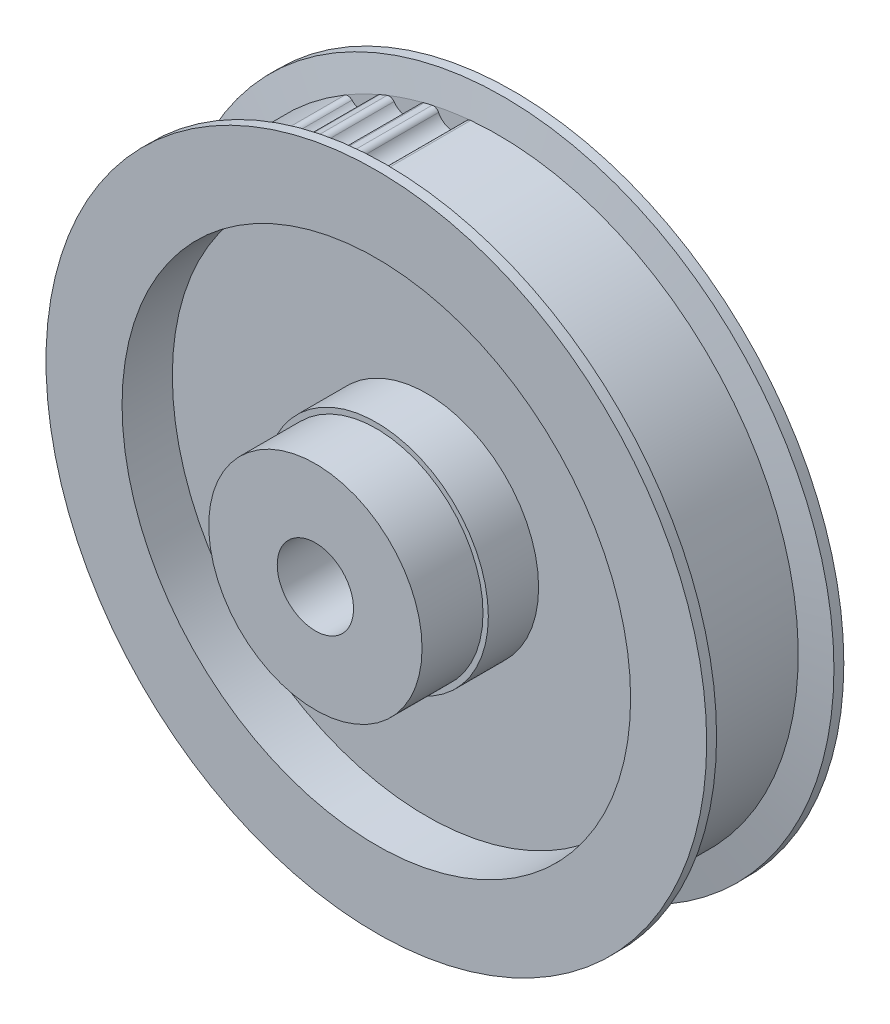
ISO-10303-21;
HEADER;
FILE_DESCRIPTION(('STEP AP214'),'2;1');
FILE_NAME('part.step','',(''),(''),'','','');
FILE_SCHEMA(('AUTOMOTIVE_DESIGN { 1 0 10303 214 1 1 1 1 }'));
ENDSEC;
DATA;
#1=APPLICATION_CONTEXT('core data for automotive mechanical design processes');
#2=APPLICATION_PROTOCOL_DEFINITION('international standard','automotive_design',2000,#1);
#3=PRODUCT_CONTEXT('',#1,'mechanical');
#4=PRODUCT('Part','Part','',(#3));
#5=PRODUCT_RELATED_PRODUCT_CATEGORY('part','',(#4));
#6=PRODUCT_DEFINITION_FORMATION('','',#4);
#7=PRODUCT_DEFINITION_CONTEXT('part definition',#1,'design');
#8=PRODUCT_DEFINITION('design','',#6,#7);
#9=PRODUCT_DEFINITION_SHAPE('','',#8);
#10=(LENGTH_UNIT() NAMED_UNIT(*) SI_UNIT(.MILLI.,.METRE.));
#11=(NAMED_UNIT(*) PLANE_ANGLE_UNIT() SI_UNIT($,.RADIAN.));
#12=(NAMED_UNIT(*) SI_UNIT($,.STERADIAN.) SOLID_ANGLE_UNIT());
#13=UNCERTAINTY_MEASURE_WITH_UNIT(LENGTH_MEASURE(1.E-05),#10,'distance_accuracy_value','');
#14=(GEOMETRIC_REPRESENTATION_CONTEXT(3) GLOBAL_UNCERTAINTY_ASSIGNED_CONTEXT((#13)) GLOBAL_UNIT_ASSIGNED_CONTEXT((#10,
#11,#12)) REPRESENTATION_CONTEXT('',''));
#15=CARTESIAN_POINT('',(0.,0.,0.));
#16=DIRECTION('',(0.,0.,1.));
#17=DIRECTION('',(1.,0.,0.));
#18=AXIS2_PLACEMENT_3D('',#15,#16,#17);
#19=CARTESIAN_POINT('',(0.,0.,13.49375));
#20=DIRECTION('',(0.,0.,1.));
#21=DIRECTION('',(1.,0.,0.));
#22=AXIS2_PLACEMENT_3D('',#19,#20,#21);
#23=PLANE('',#22);
#24=CARTESIAN_POINT('',(0.,0.,13.49375));
#25=DIRECTION('',(0.,0.,-1.));
#26=DIRECTION('',(-1.,0.,0.));
#27=AXIS2_PLACEMENT_3D('',#24,#25,#26);
#28=CIRCLE('',#27,3.9751);
#29=CARTESIAN_POINT('',(-3.9751,0.,13.49375));
#30=VERTEX_POINT('',#29);
#31=EDGE_CURVE('E19',#30,#30,#28,.T.);
#32=ORIENTED_EDGE('',*,*,#31,.T.);
#33=EDGE_LOOP('',(#32));
#34=FACE_BOUND('',#33,.T.);
#35=CARTESIAN_POINT('',(0.,0.,13.49375));
#36=DIRECTION('',(0.,0.,1.));
#37=DIRECTION('',(1.,0.,0.));
#38=AXIS2_PLACEMENT_3D('',#35,#36,#37);
#39=CIRCLE('',#38,11.1125);
#40=CARTESIAN_POINT('',(11.1125,0.,13.49375));
#41=VERTEX_POINT('',#40);
#42=EDGE_CURVE('E272',#41,#41,#39,.F.);
#43=ORIENTED_EDGE('',*,*,#42,.F.);
#44=EDGE_LOOP('',(#43));
#45=FACE_BOUND('',#44,.T.);
#46=ADVANCED_FACE('F16',(#34,#45),#23,.T.);
#47=CARTESIAN_POINT('',(0.,0.,13.49375));
#48=DIRECTION('',(0.,0.,-1.));
#49=DIRECTION('',(-1.,0.,0.));
#50=AXIS2_PLACEMENT_3D('',#47,#48,#49);
#51=CYLINDRICAL_SURFACE('',#50,3.9751);
#52=ORIENTED_EDGE('',*,*,#31,.F.);
#53=EDGE_LOOP('',(#52));
#54=FACE_BOUND('',#53,.T.);
#55=CARTESIAN_POINT('',(0.,0.,-7.14375));
#56=DIRECTION('',(0.,0.,-1.));
#57=DIRECTION('',(-1.,0.,0.));
#58=AXIS2_PLACEMENT_3D('',#55,#56,#57);
#59=CIRCLE('',#58,3.9751);
#60=CARTESIAN_POINT('',(-3.9751,0.,-7.14375));
#61=VERTEX_POINT('',#60);
#62=EDGE_CURVE('E270',#61,#61,#59,.T.);
#63=ORIENTED_EDGE('',*,*,#62,.T.);
#64=EDGE_LOOP('',(#63));
#65=FACE_BOUND('',#64,.T.);
#66=ADVANCED_FACE('F281',(#54,#65),#51,.F.);
#67=CARTESIAN_POINT('',(0.,0.,7.14375));
#68=DIRECTION('',(0.,0.,1.));
#69=DIRECTION('',(1.,0.,0.));
#70=AXIS2_PLACEMENT_3D('',#67,#68,#69);
#71=CYLINDRICAL_SURFACE('',#70,11.1125);
#72=ORIENTED_EDGE('',*,*,#42,.T.);
#73=EDGE_LOOP('',(#72));
#74=FACE_BOUND('',#73,.T.);
#75=CARTESIAN_POINT('',(0.,0.,7.14375));
#76=DIRECTION('',(0.,0.,1.));
#77=DIRECTION('',(1.,0.,0.));
#78=AXIS2_PLACEMENT_3D('',#75,#76,#77);
#79=CIRCLE('',#78,11.1125);
#80=CARTESIAN_POINT('',(11.1125,0.,7.14375));
#81=VERTEX_POINT('',#80);
#82=EDGE_CURVE('E267',#81,#81,#79,.F.);
#83=ORIENTED_EDGE('',*,*,#82,.F.);
#84=EDGE_LOOP('',(#83));
#85=FACE_BOUND('',#84,.T.);
#86=ADVANCED_FACE('F284',(#74,#85),#71,.T.);
#87=CARTESIAN_POINT('',(0.,0.,-7.14375));
#88=DIRECTION('',(0.,0.,1.));
#89=DIRECTION('',(1.,0.,0.));
#90=AXIS2_PLACEMENT_3D('',#87,#88,#89);
#91=PLANE('',#90);
#92=ORIENTED_EDGE('',*,*,#62,.F.);
#93=EDGE_LOOP('',(#92));
#94=FACE_BOUND('',#93,.T.);
#95=CARTESIAN_POINT('',(0.,0.,-7.14375));
#96=DIRECTION('',(0.,0.,1.));
#97=DIRECTION('',(1.,0.,0.));
#98=AXIS2_PLACEMENT_3D('',#95,#96,#97);
#99=CIRCLE('',#98,11.668125);
#100=CARTESIAN_POINT('',(11.668125,0.,-7.14375));
#101=VERTEX_POINT('',#100);
#102=EDGE_CURVE('E264',#101,#101,#99,.T.);
#103=ORIENTED_EDGE('',*,*,#102,.F.);
#104=EDGE_LOOP('',(#103));
#105=FACE_BOUND('',#104,.T.);
#106=ADVANCED_FACE('F287',(#94,#105),#91,.F.);
#107=CARTESIAN_POINT('',(0.,0.,7.14375));
#108=DIRECTION('',(0.,0.,1.));
#109=DIRECTION('',(1.,0.,0.));
#110=AXIS2_PLACEMENT_3D('',#107,#108,#109);
#111=PLANE('',#110);
#112=ORIENTED_EDGE('',*,*,#82,.T.);
#113=EDGE_LOOP('',(#112));
#114=FACE_BOUND('',#113,.T.);
#115=CARTESIAN_POINT('',(0.,0.,7.14375));
#116=DIRECTION('',(0.,0.,1.));
#117=DIRECTION('',(1.,0.,0.));
#118=AXIS2_PLACEMENT_3D('',#115,#116,#117);
#119=CIRCLE('',#118,11.668125);
#120=CARTESIAN_POINT('',(11.668125,0.,7.14375));
#121=VERTEX_POINT('',#120);
#122=EDGE_CURVE('E261',#121,#121,#119,.F.);
#123=ORIENTED_EDGE('',*,*,#122,.F.);
#124=EDGE_LOOP('',(#123));
#125=FACE_BOUND('',#124,.T.);
#126=ADVANCED_FACE('F290',(#114,#125),#111,.T.);
#127=CARTESIAN_POINT('',(0.,0.,-7.858125));
#128=DIRECTION('',(0.,0.,1.));
#129=DIRECTION('',(1.,0.,0.));
#130=AXIS2_PLACEMENT_3D('',#127,#128,#129);
#131=CYLINDRICAL_SURFACE('',#130,11.668125);
#132=CARTESIAN_POINT('',(0.,0.,-1.79916666666658));
#133=DIRECTION('',(0.,0.,1.));
#134=DIRECTION('',(1.,0.,0.));
#135=AXIS2_PLACEMENT_3D('',#132,#133,#134);
#136=CIRCLE('',#135,11.668125);
#137=CARTESIAN_POINT('',(11.668125,0.,-1.79916666666658));
#138=VERTEX_POINT('',#137);
#139=EDGE_CURVE('E258',#138,#138,#136,.F.);
#140=ORIENTED_EDGE('',*,*,#139,.T.);
#141=EDGE_LOOP('',(#140));
#142=FACE_BOUND('',#141,.T.);
#143=ORIENTED_EDGE('',*,*,#102,.T.);
#144=EDGE_LOOP('',(#143));
#145=FACE_BOUND('',#144,.T.);
#146=ADVANCED_FACE('F294',(#142,#145),#131,.T.);
#147=CARTESIAN_POINT('',(0.,0.,-7.858125));
#148=DIRECTION('',(0.,0.,1.));
#149=DIRECTION('',(1.,0.,0.));
#150=AXIS2_PLACEMENT_3D('',#147,#148,#149);
#151=CYLINDRICAL_SURFACE('',#150,11.668125);
#152=CARTESIAN_POINT('',(0.,0.,1.905));
#153=DIRECTION('',(0.,0.,1.));
#154=DIRECTION('',(1.,0.,0.));
#155=AXIS2_PLACEMENT_3D('',#152,#153,#154);
#156=CIRCLE('',#155,11.668125);
#157=CARTESIAN_POINT('',(11.668125,0.,1.905));
#158=VERTEX_POINT('',#157);
#159=EDGE_CURVE('E154',#158,#158,#156,.F.);
#160=ORIENTED_EDGE('',*,*,#159,.F.);
#161=EDGE_LOOP('',(#160));
#162=FACE_BOUND('',#161,.T.);
#163=ORIENTED_EDGE('',*,*,#122,.T.);
#164=EDGE_LOOP('',(#163));
#165=FACE_BOUND('',#164,.T.);
#166=ADVANCED_FACE('F296',(#162,#165),#151,.T.);
#167=CARTESIAN_POINT('',(0.,0.,-1.79916666666658));
#168=DIRECTION('',(0.,0.,1.));
#169=DIRECTION('',(1.,0.,0.));
#170=AXIS2_PLACEMENT_3D('',#167,#168,#169);
#171=PLANE('',#170);
#172=ORIENTED_EDGE('',*,*,#139,.F.);
#173=EDGE_LOOP('',(#172));
#174=FACE_BOUND('',#173,.T.);
#175=CARTESIAN_POINT('',(0.,0.,-1.79916666666658));
#176=DIRECTION('',(0.,0.,1.));
#177=DIRECTION('',(1.,0.,0.));
#178=AXIS2_PLACEMENT_3D('',#175,#176,#177);
#179=CIRCLE('',#178,26.4922);
#180=CARTESIAN_POINT('',(26.4922,0.,-1.79916666666658));
#181=VERTEX_POINT('',#180);
#182=EDGE_CURVE('E252',#181,#181,#179,.F.);
#183=ORIENTED_EDGE('',*,*,#182,.T.);
#184=EDGE_LOOP('',(#183));
#185=FACE_BOUND('',#184,.T.);
#186=ADVANCED_FACE('F304',(#174,#185),#171,.F.);
#187=CARTESIAN_POINT('',(0.,0.,1.905));
#188=DIRECTION('',(0.,0.,1.));
#189=DIRECTION('',(1.,0.,0.));
#190=AXIS2_PLACEMENT_3D('',#187,#188,#189);
#191=PLANE('',#190);
#192=ORIENTED_EDGE('',*,*,#159,.T.);
#193=EDGE_LOOP('',(#192));
#194=FACE_BOUND('',#193,.T.);
#195=CARTESIAN_POINT('',(0.,0.,1.905));
#196=DIRECTION('',(0.,0.,1.));
#197=DIRECTION('',(1.,0.,0.));
#198=AXIS2_PLACEMENT_3D('',#195,#196,#197);
#199=CIRCLE('',#198,26.4922);
#200=CARTESIAN_POINT('',(26.4922,0.,1.905));
#201=VERTEX_POINT('',#200);
#202=EDGE_CURVE('E131',#201,#201,#199,.T.);
#203=ORIENTED_EDGE('',*,*,#202,.T.);
#204=EDGE_LOOP('',(#203));
#205=FACE_BOUND('',#204,.T.);
#206=ADVANCED_FACE('F420',(#194,#205),#191,.T.);
#207=CARTESIAN_POINT('',(0.,0.,-6.7252336922032));
#208=DIRECTION('',(0.,0.,1.));
#209=DIRECTION('',(1.,0.,0.));
#210=AXIS2_PLACEMENT_3D('',#207,#208,#209);
#211=CYLINDRICAL_SURFACE('',#210,31.2547);
#212=CARTESIAN_POINT('',(0.,0.,-5.55625));
#213=DIRECTION('',(0.,0.,1.));
#214=DIRECTION('',(1.,0.,0.));
#215=AXIS2_PLACEMENT_3D('',#212,#213,#214);
#216=CIRCLE('',#215,31.2547);
#217=CARTESIAN_POINT('',(-6.88663106216912,30.4865640029068,-5.5562499999993));
#218=VERTEX_POINT('',#217);
#219=CARTESIAN_POINT('',(-7.70457722095122,30.2901925041179,-5.55624999999913));
#220=VERTEX_POINT('',#219);
#221=EDGE_CURVE('E153',#218,#220,#216,.T.);
#222=ORIENTED_EDGE('',*,*,#221,.T.);
#223=DIRECTION('',(0.,0.,1.));
#224=VECTOR('',#223,1.);
#225=CARTESIAN_POINT('',(-7.70457722092588,30.2901925041244,5.55625));
#226=LINE('',#225,#224);
#227=CARTESIAN_POINT('',(-7.70457722095152,30.2901925041191,5.55625000000015));
#228=VERTEX_POINT('',#227);
#229=EDGE_CURVE('E151',#228,#220,#226,.F.);
#230=ORIENTED_EDGE('',*,*,#229,.F.);
#231=CARTESIAN_POINT('',(0.,0.,5.55625));
#232=DIRECTION('',(0.,0.,1.));
#233=DIRECTION('',(1.,0.,0.));
#234=AXIS2_PLACEMENT_3D('',#231,#232,#233);
#235=CIRCLE('',#234,31.2547);
#236=CARTESIAN_POINT('',(-6.88663106216869,30.4865640029049,5.55624999999942));
#237=VERTEX_POINT('',#236);
#238=EDGE_CURVE('E137',#228,#237,#235,.F.);
#239=ORIENTED_EDGE('',*,*,#238,.T.);
#240=DIRECTION('',(0.,0.,1.));
#241=VECTOR('',#240,1.);
#242=CARTESIAN_POINT('',(-6.88663106219376,30.4865640028975,5.55625));
#243=LINE('',#242,#241);
#244=EDGE_CURVE('E148',#218,#237,#243,.T.);
#245=ORIENTED_EDGE('',*,*,#244,.F.);
#246=EDGE_LOOP('',(#222,#230,#239,#245));
#247=FACE_BOUND('',#246,.T.);
#248=ADVANCED_FACE('F147',(#247),#211,.T.);
#249=CARTESIAN_POINT('',(0.,0.,-6.7252336922032));
#250=DIRECTION('',(0.,0.,1.));
#251=DIRECTION('',(1.,0.,0.));
#252=AXIS2_PLACEMENT_3D('',#249,#250,#251);
#253=CYLINDRICAL_SURFACE('',#252,31.2547);
#254=CARTESIAN_POINT('',(0.,0.,-5.55625));
#255=DIRECTION('',(0.,0.,1.));
#256=DIRECTION('',(1.,0.,0.));
#257=AXIS2_PLACEMENT_3D('',#254,#255,#256);
#258=CIRCLE('',#257,31.2547);
#259=CARTESIAN_POINT('',(-11.5709945367935,29.033917364339,-5.55625000000002));
#260=VERTEX_POINT('',#259);
#261=CARTESIAN_POINT('',(-12.3481511506968,28.712008554779,-5.55625));
#262=VERTEX_POINT('',#261);
#263=EDGE_CURVE('E255',#260,#262,#258,.T.);
#264=ORIENTED_EDGE('',*,*,#263,.T.);
#265=DIRECTION('',(0.,0.,1.));
#266=VECTOR('',#265,1.);
#267=CARTESIAN_POINT('',(-12.3481511506728,28.7120085547892,5.55625));
#268=LINE('',#267,#266);
#269=CARTESIAN_POINT('',(-12.3481511506961,28.7120085547773,5.55624999999968));
#270=VERTEX_POINT('',#269);
#271=EDGE_CURVE('E238',#270,#262,#268,.F.);
#272=ORIENTED_EDGE('',*,*,#271,.F.);
#273=CARTESIAN_POINT('',(0.,0.,5.55625));
#274=DIRECTION('',(0.,0.,1.));
#275=DIRECTION('',(1.,0.,0.));
#276=AXIS2_PLACEMENT_3D('',#273,#274,#275);
#277=CIRCLE('',#276,31.2547);
#278=CARTESIAN_POINT('',(-11.5709945367955,29.033917364344,5.55625000000015));
#279=VERTEX_POINT('',#278);
#280=EDGE_CURVE('E447',#270,#279,#277,.F.);
#281=ORIENTED_EDGE('',*,*,#280,.T.);
#282=DIRECTION('',(0.,0.,1.));
#283=VECTOR('',#282,1.);
#284=CARTESIAN_POINT('',(-11.5709945368012,29.0339173643387,5.55625));
#285=LINE('',#284,#283);
#286=EDGE_CURVE('E164',#260,#279,#285,.T.);
#287=ORIENTED_EDGE('',*,*,#286,.F.);
#288=EDGE_LOOP('',(#264,#272,#281,#287));
#289=FACE_BOUND('',#288,.T.);
#290=ADVANCED_FACE('F413',(#289),#253,.T.);
#291=CARTESIAN_POINT('',(0.,0.,-7.858125));
#292=DIRECTION('',(0.,0.,1.));
#293=DIRECTION('',(1.,0.,0.));
#294=AXIS2_PLACEMENT_3D('',#291,#292,#293);
#295=CYLINDRICAL_SURFACE('',#294,26.4922);
#296=ORIENTED_EDGE('',*,*,#182,.F.);
#297=EDGE_LOOP('',(#296));
#298=FACE_BOUND('',#297,.T.);
#299=CARTESIAN_POINT('',(0.,0.,-7.14375));
#300=DIRECTION('',(0.,0.,1.));
#301=DIRECTION('',(1.,0.,0.));
#302=AXIS2_PLACEMENT_3D('',#299,#300,#301);
#303=CIRCLE('',#302,26.4922);
#304=CARTESIAN_POINT('',(26.4922,0.,-7.14375));
#305=VERTEX_POINT('',#304);
#306=EDGE_CURVE('E235',#305,#305,#303,.F.);
#307=ORIENTED_EDGE('',*,*,#306,.T.);
#308=EDGE_LOOP('',(#307));
#309=FACE_BOUND('',#308,.T.);
#310=ADVANCED_FACE('F409',(#298,#309),#295,.F.);
#311=CARTESIAN_POINT('',(0.,0.,-7.858125));
#312=DIRECTION('',(0.,0.,1.));
#313=DIRECTION('',(1.,0.,0.));
#314=AXIS2_PLACEMENT_3D('',#311,#312,#313);
#315=CYLINDRICAL_SURFACE('',#314,26.4922);
#316=ORIENTED_EDGE('',*,*,#202,.F.);
#317=EDGE_LOOP('',(#316));
#318=FACE_BOUND('',#317,.T.);
#319=CARTESIAN_POINT('',(0.,0.,7.14375));
#320=DIRECTION('',(0.,0.,1.));
#321=DIRECTION('',(1.,0.,0.));
#322=AXIS2_PLACEMENT_3D('',#319,#320,#321);
#323=CIRCLE('',#322,26.4922);
#324=CARTESIAN_POINT('',(26.4922,0.,7.14375));
#325=VERTEX_POINT('',#324);
#326=EDGE_CURVE('E231',#325,#325,#323,.F.);
#327=ORIENTED_EDGE('',*,*,#326,.F.);
#328=EDGE_LOOP('',(#327));
#329=FACE_BOUND('',#328,.T.);
#330=ADVANCED_FACE('F406',(#318,#329),#315,.F.);
#331=CARTESIAN_POINT('',(-6.75455101901674,29.9018562333282,5.55625));
#332=DIRECTION('',(0.,0.,1.));
#333=DIRECTION('',(1.,0.,0.));
#334=AXIS2_PLACEMENT_3D('',#331,#332,#333);
#335=CYLINDRICAL_SURFACE('',#334,0.599440000000254);
#336=CARTESIAN_POINT('',(-6.75455101901674,29.9018562333282,-5.55625));
#337=DIRECTION('',(0.,0.,1.));
#338=DIRECTION('',(1.,0.,0.));
#339=AXIS2_PLACEMENT_3D('',#336,#337,#338);
#340=CIRCLE('',#339,0.599440000000254);
#341=CARTESIAN_POINT('',(-6.2172925757956,30.167716495105,-5.55625));
#342=VERTEX_POINT('',#341);
#343=EDGE_CURVE('E130',#342,#218,#340,.T.);
#344=ORIENTED_EDGE('',*,*,#343,.T.);
#345=ORIENTED_EDGE('',*,*,#244,.T.);
#346=CARTESIAN_POINT('',(-6.75455101901674,29.9018562333282,5.55625));
#347=DIRECTION('',(0.,0.,1.));
#348=DIRECTION('',(1.,0.,0.));
#349=AXIS2_PLACEMENT_3D('',#346,#347,#348);
#350=CIRCLE('',#349,0.599440000000254);
#351=CARTESIAN_POINT('',(-6.2172925757956,30.167716495105,5.55625));
#352=VERTEX_POINT('',#351);
#353=EDGE_CURVE('E118',#237,#352,#350,.F.);
#354=ORIENTED_EDGE('',*,*,#353,.T.);
#355=DIRECTION('',(0.,0.,1.));
#356=VECTOR('',#355,1.);
#357=CARTESIAN_POINT('',(-6.21729257579287,30.1677164951072,5.55625));
#358=LINE('',#357,#356);
#359=EDGE_CURVE('E234',#352,#342,#358,.F.);
#360=ORIENTED_EDGE('',*,*,#359,.T.);
#361=EDGE_LOOP('',(#344,#345,#354,#360));
#362=FACE_BOUND('',#361,.T.);
#363=ADVANCED_FACE('F156',(#362),#335,.T.);
#364=CARTESIAN_POINT('',(-11.3490721710102,28.4770701885702,5.55625));
#365=DIRECTION('',(0.,0.,1.));
#366=DIRECTION('',(1.,0.,0.));
#367=AXIS2_PLACEMENT_3D('',#364,#365,#366);
#368=CYLINDRICAL_SURFACE('',#367,0.599439999999746);
#369=CARTESIAN_POINT('',(-11.3490721710102,28.4770701885702,-5.55625));
#370=DIRECTION('',(0.,0.,1.));
#371=DIRECTION('',(1.,0.,0.));
#372=AXIS2_PLACEMENT_3D('',#369,#370,#371);
#373=CIRCLE('',#372,0.599439999999746);
#374=CARTESIAN_POINT('',(-10.8600179785813,28.8237030065045,-5.55625));
#375=VERTEX_POINT('',#374);
#376=EDGE_CURVE('E159',#375,#260,#373,.T.);
#377=ORIENTED_EDGE('',*,*,#376,.T.);
#378=ORIENTED_EDGE('',*,*,#286,.T.);
#379=CARTESIAN_POINT('',(-11.3490721710102,28.4770701885702,5.55625));
#380=DIRECTION('',(0.,0.,1.));
#381=DIRECTION('',(1.,0.,0.));
#382=AXIS2_PLACEMENT_3D('',#379,#380,#381);
#383=CIRCLE('',#382,0.599439999999746);
#384=CARTESIAN_POINT('',(-10.8600179785813,28.8237030065045,5.55625));
#385=VERTEX_POINT('',#384);
#386=EDGE_CURVE('E157',#279,#385,#383,.F.);
#387=ORIENTED_EDGE('',*,*,#386,.T.);
#388=DIRECTION('',(0.,0.,1.));
#389=VECTOR('',#388,1.);
#390=CARTESIAN_POINT('',(-10.8600179785805,28.8237030065057,5.55625));
#391=LINE('',#390,#389);
#392=EDGE_CURVE('E465',#385,#375,#391,.F.);
#393=ORIENTED_EDGE('',*,*,#392,.T.);
#394=EDGE_LOOP('',(#377,#378,#387,#393));
#395=FACE_BOUND('',#394,.T.);
#396=ADVANCED_FACE('F399',(#395),#368,.T.);
#397=CARTESIAN_POINT('',(-7.5568096286035,29.7092509818872,5.55625));
#398=DIRECTION('',(0.,0.,1.));
#399=DIRECTION('',(1.,0.,0.));
#400=AXIS2_PLACEMENT_3D('',#397,#398,#399);
#401=CYLINDRICAL_SURFACE('',#400,0.59944);
#402=CARTESIAN_POINT('',(-7.5568096286035,29.7092509818872,5.55625));
#403=DIRECTION('',(0.,0.,1.));
#404=DIRECTION('',(1.,0.,0.));
#405=AXIS2_PLACEMENT_3D('',#402,#403,#404);
#406=CIRCLE('',#405,0.59944);
#407=CARTESIAN_POINT('',(-8.15620843979027,29.7022239805229,5.55625));
#408=VERTEX_POINT('',#407);
#409=EDGE_CURVE('E244',#408,#228,#406,.F.);
#410=ORIENTED_EDGE('',*,*,#409,.T.);
#411=ORIENTED_EDGE('',*,*,#229,.T.);
#412=CARTESIAN_POINT('',(-7.5568096286035,29.7092509818872,-5.55625));
#413=DIRECTION('',(0.,0.,1.));
#414=DIRECTION('',(1.,0.,0.));
#415=AXIS2_PLACEMENT_3D('',#412,#413,#414);
#416=CIRCLE('',#415,0.59944);
#417=CARTESIAN_POINT('',(-8.15620843979027,29.7022239805229,-5.55625));
#418=VERTEX_POINT('',#417);
#419=EDGE_CURVE('E246',#220,#418,#416,.T.);
#420=ORIENTED_EDGE('',*,*,#419,.T.);
#421=DIRECTION('',(0.,0.,1.));
#422=VECTOR('',#421,1.);
#423=CARTESIAN_POINT('',(-8.15620843979053,29.7022239805234,5.55625));
#424=LINE('',#423,#422);
#425=EDGE_CURVE('E456',#418,#408,#424,.T.);
#426=ORIENTED_EDGE('',*,*,#425,.T.);
#427=EDGE_LOOP('',(#410,#411,#420,#426));
#428=FACE_BOUND('',#427,.T.);
#429=ADVANCED_FACE('F395',(#428),#401,.T.);
#430=CARTESIAN_POINT('',(-12.1113235463672,28.1613353309632,5.55625));
#431=DIRECTION('',(0.,0.,1.));
#432=DIRECTION('',(1.,0.,0.));
#433=AXIS2_PLACEMENT_3D('',#430,#431,#432);
#434=CYLINDRICAL_SURFACE('',#433,0.59944);
#435=CARTESIAN_POINT('',(-12.1113235463672,28.1613353309632,5.55625));
#436=DIRECTION('',(0.,0.,1.));
#437=DIRECTION('',(1.,0.,0.));
#438=AXIS2_PLACEMENT_3D('',#435,#436,#437);
#439=CIRCLE('',#438,0.59944);
#440=CARTESIAN_POINT('',(-12.7022434983433,28.0606282112694,5.55625));
#441=VERTEX_POINT('',#440);
#442=EDGE_CURVE('E239',#441,#270,#439,.F.);
#443=ORIENTED_EDGE('',*,*,#442,.T.);
#444=ORIENTED_EDGE('',*,*,#271,.T.);
#445=CARTESIAN_POINT('',(-12.1113235463672,28.1613353309632,-5.55625));
#446=DIRECTION('',(0.,0.,1.));
#447=DIRECTION('',(1.,0.,0.));
#448=AXIS2_PLACEMENT_3D('',#445,#446,#447);
#449=CIRCLE('',#448,0.59944);
#450=CARTESIAN_POINT('',(-12.7022434983433,28.0606282112694,-5.55625));
#451=VERTEX_POINT('',#450);
#452=EDGE_CURVE('E242',#262,#451,#449,.T.);
#453=ORIENTED_EDGE('',*,*,#452,.T.);
#454=DIRECTION('',(0.,0.,1.));
#455=VECTOR('',#454,1.);
#456=CARTESIAN_POINT('',(-12.7022434983438,28.0606282112702,5.55625));
#457=LINE('',#456,#455);
#458=EDGE_CURVE('E230',#451,#441,#457,.T.);
#459=ORIENTED_EDGE('',*,*,#458,.T.);
#460=EDGE_LOOP('',(#443,#444,#453,#459));
#461=FACE_BOUND('',#460,.T.);
#462=ADVANCED_FACE('F391',(#461),#434,.T.);
#463=CARTESIAN_POINT('',(0.,0.,-7.14375));
#464=DIRECTION('',(0.,0.,1.));
#465=DIRECTION('',(1.,0.,0.));
#466=AXIS2_PLACEMENT_3D('',#463,#464,#465);
#467=PLANE('',#466);
#468=ORIENTED_EDGE('',*,*,#306,.F.);
#469=EDGE_LOOP('',(#468));
#470=FACE_BOUND('',#469,.T.);
#471=CARTESIAN_POINT('',(0.,0.,-7.14375));
#472=DIRECTION('',(0.,0.,1.));
#473=DIRECTION('',(1.,0.,0.));
#474=AXIS2_PLACEMENT_3D('',#471,#472,#473);
#475=CIRCLE('',#474,34.417);
#476=CARTESIAN_POINT('',(34.417,0.,-7.14375));
#477=VERTEX_POINT('',#476);
#478=EDGE_CURVE('E215',#477,#477,#475,.T.);
#479=ORIENTED_EDGE('',*,*,#478,.F.);
#480=EDGE_LOOP('',(#479));
#481=FACE_BOUND('',#480,.T.);
#482=ADVANCED_FACE('F387',(#470,#481),#467,.F.);
#483=CARTESIAN_POINT('',(0.,0.,7.14375));
#484=DIRECTION('',(0.,0.,1.));
#485=DIRECTION('',(1.,0.,0.));
#486=AXIS2_PLACEMENT_3D('',#483,#484,#485);
#487=PLANE('',#486);
#488=ORIENTED_EDGE('',*,*,#326,.T.);
#489=EDGE_LOOP('',(#488));
#490=FACE_BOUND('',#489,.T.);
#491=CARTESIAN_POINT('',(0.,0.,7.14375));
#492=DIRECTION('',(0.,0.,1.));
#493=DIRECTION('',(1.,0.,0.));
#494=AXIS2_PLACEMENT_3D('',#491,#492,#493);
#495=CIRCLE('',#494,34.417);
#496=CARTESIAN_POINT('',(34.417,0.,7.14375));
#497=VERTEX_POINT('',#496);
#498=EDGE_CURVE('E203',#497,#497,#495,.F.);
#499=ORIENTED_EDGE('',*,*,#498,.F.);
#500=EDGE_LOOP('',(#499));
#501=FACE_BOUND('',#500,.T.);
#502=ADVANCED_FACE('F383',(#490,#501),#487,.T.);
#503=CARTESIAN_POINT('',(-4.69430148039782,30.9213627456446,5.55625));
#504=DIRECTION('',(0.,0.,1.));
#505=DIRECTION('',(1.,0.,0.));
#506=AXIS2_PLACEMENT_3D('',#503,#504,#505);
#507=CYLINDRICAL_SURFACE('',#506,1.69926000000051);
#508=CARTESIAN_POINT('',(-4.69430148039782,30.9213627456446,-5.55625));
#509=DIRECTION('',(0.,0.,1.));
#510=DIRECTION('',(1.,0.,0.));
#511=AXIS2_PLACEMENT_3D('',#508,#509,#510);
#512=CIRCLE('',#511,1.69926000000051);
#513=CARTESIAN_POINT('',(-4.62852807923582,29.2233761711047,-5.55625));
#514=VERTEX_POINT('',#513);
#515=EDGE_CURVE('E221',#342,#514,#512,.T.);
#516=ORIENTED_EDGE('',*,*,#515,.F.);
#517=ORIENTED_EDGE('',*,*,#359,.F.);
#518=CARTESIAN_POINT('',(-4.69430148039782,30.9213627456446,5.55625));
#519=DIRECTION('',(0.,0.,1.));
#520=DIRECTION('',(1.,0.,0.));
#521=AXIS2_PLACEMENT_3D('',#518,#519,#520);
#522=CIRCLE('',#521,1.69926000000051);
#523=CARTESIAN_POINT('',(-4.62852807923582,29.2233761711047,5.55625));
#524=VERTEX_POINT('',#523);
#525=EDGE_CURVE('E125',#352,#524,#522,.T.);
#526=ORIENTED_EDGE('',*,*,#525,.T.);
#527=DIRECTION('',(0.,0.,1.));
#528=VECTOR('',#527,1.);
#529=CARTESIAN_POINT('',(-4.62852807925548,29.2233761710992,5.55625));
#530=LINE('',#529,#528);
#531=EDGE_CURVE('E209',#524,#514,#530,.F.);
#532=ORIENTED_EDGE('',*,*,#531,.T.);
#533=EDGE_LOOP('',(#516,#517,#526,#532));
#534=FACE_BOUND('',#533,.T.);
#535=ADVANCED_FACE('F379',(#534),#507,.F.);
#536=CARTESIAN_POINT('',(-9.47367367885808,29.806318918358,5.55625));
#537=DIRECTION('',(0.,0.,1.));
#538=DIRECTION('',(1.,0.,0.));
#539=AXIS2_PLACEMENT_3D('',#536,#537,#538);
#540=CYLINDRICAL_SURFACE('',#539,1.69925999999949);
#541=CARTESIAN_POINT('',(-9.47367367885808,29.806318918358,-5.55625));
#542=DIRECTION('',(0.,0.,1.));
#543=DIRECTION('',(1.,0.,0.));
#544=AXIS2_PLACEMENT_3D('',#541,#542,#543);
#545=CIRCLE('',#544,1.69925999999949);
#546=CARTESIAN_POINT('',(-9.14308643599467,28.1395266030259,-5.55625));
#547=VERTEX_POINT('',#546);
#548=EDGE_CURVE('E227',#375,#547,#545,.T.);
#549=ORIENTED_EDGE('',*,*,#548,.F.);
#550=ORIENTED_EDGE('',*,*,#392,.F.);
#551=CARTESIAN_POINT('',(-9.47367367885808,29.806318918358,5.55625));
#552=DIRECTION('',(0.,0.,1.));
#553=DIRECTION('',(1.,0.,0.));
#554=AXIS2_PLACEMENT_3D('',#551,#552,#553);
#555=CIRCLE('',#554,1.69925999999949);
#556=CARTESIAN_POINT('',(-9.14308643599467,28.1395266030259,5.55625));
#557=VERTEX_POINT('',#556);
#558=EDGE_CURVE('E198',#385,#557,#555,.T.);
#559=ORIENTED_EDGE('',*,*,#558,.T.);
#560=DIRECTION('',(0.,0.,1.));
#561=VECTOR('',#560,1.);
#562=CARTESIAN_POINT('',(-9.14308643598989,28.1395266030281,5.55625));
#563=LINE('',#562,#561);
#564=EDGE_CURVE('E491',#557,#547,#563,.F.);
#565=ORIENTED_EDGE('',*,*,#564,.T.);
#566=EDGE_LOOP('',(#549,#550,#559,#565));
#567=FACE_BOUND('',#566,.T.);
#568=ADVANCED_FACE('F375',(#567),#540,.F.);
#569=CARTESIAN_POINT('',(-9.85535167997604,29.6823042181786,5.55625));
#570=DIRECTION('',(0.,0.,1.));
#571=DIRECTION('',(1.,0.,0.));
#572=AXIS2_PLACEMENT_3D('',#569,#570,#571);
#573=CYLINDRICAL_SURFACE('',#572,1.69926);
#574=CARTESIAN_POINT('',(-9.85535167997604,29.6823042181786,-5.55625));
#575=DIRECTION('',(0.,0.,1.));
#576=DIRECTION('',(1.,0.,0.));
#577=AXIS2_PLACEMENT_3D('',#574,#575,#576);
#578=CIRCLE('',#577,1.69926);
#579=EDGE_CURVE('E224',#547,#418,#578,.T.);
#580=ORIENTED_EDGE('',*,*,#579,.F.);
#581=ORIENTED_EDGE('',*,*,#564,.F.);
#582=CARTESIAN_POINT('',(-9.85535167997604,29.6823042181786,5.55625));
#583=DIRECTION('',(0.,0.,1.));
#584=DIRECTION('',(1.,0.,0.));
#585=AXIS2_PLACEMENT_3D('',#582,#583,#584);
#586=CIRCLE('',#585,1.69926);
#587=EDGE_CURVE('E195',#557,#408,#586,.T.);
#588=ORIENTED_EDGE('',*,*,#587,.T.);
#589=ORIENTED_EDGE('',*,*,#425,.F.);
#590=EDGE_LOOP('',(#580,#581,#588,#589));
#591=FACE_BOUND('',#590,.T.);
#592=ADVANCED_FACE('F371',(#591),#573,.F.);
#593=CARTESIAN_POINT('',(-14.3773513283082,27.775149130439,5.55625));
#594=DIRECTION('',(0.,0.,1.));
#595=DIRECTION('',(1.,0.,0.));
#596=AXIS2_PLACEMENT_3D('',#593,#594,#595);
#597=CYLINDRICAL_SURFACE('',#596,1.69926);
#598=CARTESIAN_POINT('',(-14.3773513283082,27.775149130439,-5.55625));
#599=DIRECTION('',(0.,0.,1.));
#600=DIRECTION('',(1.,0.,0.));
#601=AXIS2_PLACEMENT_3D('',#598,#599,#600);
#602=CIRCLE('',#601,1.69926);
#603=CARTESIAN_POINT('',(-13.4325116605087,26.3627885002358,-5.55625));
#604=VERTEX_POINT('',#603);
#605=EDGE_CURVE('E210',#604,#451,#602,.T.);
#606=ORIENTED_EDGE('',*,*,#605,.F.);
#607=DIRECTION('',(0.,0.,1.));
#608=VECTOR('',#607,1.);
#609=CARTESIAN_POINT('',(-13.432511660514,26.3627885002338,5.55625));
#610=LINE('',#609,#608);
#611=CARTESIAN_POINT('',(-13.4325116605087,26.3627885002358,5.55625));
#612=VERTEX_POINT('',#611);
#613=EDGE_CURVE('E183',#604,#612,#610,.T.);
#614=ORIENTED_EDGE('',*,*,#613,.T.);
#615=CARTESIAN_POINT('',(-14.3773513283082,27.775149130439,5.55625));
#616=DIRECTION('',(0.,0.,1.));
#617=DIRECTION('',(1.,0.,0.));
#618=AXIS2_PLACEMENT_3D('',#615,#616,#617);
#619=CIRCLE('',#618,1.69926);
#620=EDGE_CURVE('E190',#612,#441,#619,.T.);
#621=ORIENTED_EDGE('',*,*,#620,.T.);
#622=ORIENTED_EDGE('',*,*,#458,.F.);
#623=EDGE_LOOP('',(#606,#614,#621,#622));
#624=FACE_BOUND('',#623,.T.);
#625=ADVANCED_FACE('F367',(#624),#597,.F.);
#626=CARTESIAN_POINT('',(0.,0.,-5.55625));
#627=DIRECTION('',(0.,0.,1.));
#628=DIRECTION('',(1.,0.,0.));
#629=AXIS2_PLACEMENT_3D('',#626,#627,#628);
#630=PLANE('',#629);
#631=ORIENTED_EDGE('',*,*,#419,.F.);
#632=CARTESIAN_POINT('',(0.,0.,-5.55624999999823));
#633=DIRECTION('',(0.,0.,-1.));
#634=DIRECTION('',(-1.,0.,0.));
#635=AXIS2_PLACEMENT_3D('',#632,#633,#634);
#636=CIRCLE('',#635,31.2546999999927);
#637=EDGE_CURVE('E180',#260,#220,#636,.T.);
#638=ORIENTED_EDGE('',*,*,#637,.F.);
#639=ORIENTED_EDGE('',*,*,#376,.F.);
#640=ORIENTED_EDGE('',*,*,#548,.T.);
#641=ORIENTED_EDGE('',*,*,#579,.T.);
#642=EDGE_LOOP('',(#631,#638,#639,#640,#641));
#643=FACE_BOUND('',#642,.T.);
#644=ADVANCED_FACE('F363',(#643),#630,.T.);
#645=CARTESIAN_POINT('',(0.,0.,-5.55625));
#646=DIRECTION('',(0.,0.,1.));
#647=DIRECTION('',(1.,0.,0.));
#648=AXIS2_PLACEMENT_3D('',#645,#646,#647);
#649=PLANE('',#648);
#650=CARTESIAN_POINT('',(-2.81622197817216,30.5256262742794,-5.55625));
#651=DIRECTION('',(0.,0.,1.));
#652=DIRECTION('',(1.,0.,0.));
#653=AXIS2_PLACEMENT_3D('',#650,#651,#652);
#654=CIRCLE('',#653,0.59944);
#655=CARTESIAN_POINT('',(-3.40934046054626,30.612452419341,-5.55625));
#656=VERTEX_POINT('',#655);
#657=CARTESIAN_POINT('',(-2.87129103000281,31.1225313866157,-5.55624999999932));
#658=VERTEX_POINT('',#657);
#659=EDGE_CURVE('E218',#656,#658,#654,.F.);
#660=ORIENTED_EDGE('',*,*,#659,.T.);
#661=CARTESIAN_POINT('',(0.,0.,-5.55624999999861));
#662=DIRECTION('',(0.,0.,-1.));
#663=DIRECTION('',(-1.,0.,0.));
#664=AXIS2_PLACEMENT_3D('',#661,#662,#663);
#665=CIRCLE('',#664,31.2546999999948);
#666=EDGE_CURVE('E177',#218,#658,#665,.T.);
#667=ORIENTED_EDGE('',*,*,#666,.F.);
#668=ORIENTED_EDGE('',*,*,#343,.F.);
#669=ORIENTED_EDGE('',*,*,#515,.T.);
#670=CARTESIAN_POINT('',(-5.09068056524538,30.8585824661254,-5.55625));
#671=DIRECTION('',(0.,0.,1.));
#672=DIRECTION('',(1.,0.,0.));
#673=AXIS2_PLACEMENT_3D('',#670,#671,#672);
#674=CIRCLE('',#673,1.69926);
#675=EDGE_CURVE('E206',#514,#656,#674,.T.);
#676=ORIENTED_EDGE('',*,*,#675,.T.);
#677=EDGE_LOOP('',(#660,#667,#668,#669,#676));
#678=FACE_BOUND('',#677,.T.);
#679=ADVANCED_FACE('F359',(#678),#649,.T.);
#680=CARTESIAN_POINT('',(0.,0.,-7.14375));
#681=DIRECTION('',(0.,0.,1.));
#682=DIRECTION('',(1.,0.,0.));
#683=AXIS2_PLACEMENT_3D('',#680,#681,#682);
#684=CYLINDRICAL_SURFACE('',#683,34.417);
#685=ORIENTED_EDGE('',*,*,#478,.T.);
#686=EDGE_LOOP('',(#685));
#687=FACE_BOUND('',#686,.T.);
#688=CARTESIAN_POINT('',(0.,0.,-6.11384881109474));
#689=DIRECTION('',(0.,0.,-1.));
#690=DIRECTION('',(0.,-1.,0.));
#691=AXIS2_PLACEMENT_3D('',#688,#689,#690);
#692=CIRCLE('',#691,34.4169999999999);
#693=CARTESIAN_POINT('',(0.,-34.4169999999999,-6.11384881109474));
#694=VERTEX_POINT('',#693);
#695=EDGE_CURVE('E176',#694,#694,#692,.F.);
#696=ORIENTED_EDGE('',*,*,#695,.F.);
#697=EDGE_LOOP('',(#696));
#698=FACE_BOUND('',#697,.T.);
#699=ADVANCED_FACE('F355',(#687,#698),#684,.T.);
#700=CARTESIAN_POINT('',(0.,0.,-5.55625));
#701=DIRECTION('',(0.,0.,1.));
#702=DIRECTION('',(1.,0.,0.));
#703=AXIS2_PLACEMENT_3D('',#700,#701,#702);
#704=PLANE('',#703);
#705=ORIENTED_EDGE('',*,*,#452,.F.);
#706=CARTESIAN_POINT('',(0.,0.,-5.55624999999999));
#707=DIRECTION('',(0.,0.,-1.));
#708=DIRECTION('',(-1.,0.,0.));
#709=AXIS2_PLACEMENT_3D('',#706,#707,#708);
#710=CIRCLE('',#709,31.2547000000027);
#711=CARTESIAN_POINT('',(-15.970441723994,26.8663593222131,-5.55625));
#712=VERTEX_POINT('',#711);
#713=EDGE_CURVE('E173',#712,#262,#710,.T.);
#714=ORIENTED_EDGE('',*,*,#713,.F.);
#715=CARTESIAN_POINT('',(-15.6641415007425,26.351084165773,-5.55625));
#716=DIRECTION('',(0.,0.,1.));
#717=DIRECTION('',(1.,0.,0.));
#718=AXIS2_PLACEMENT_3D('',#715,#716,#717);
#719=CIRCLE('',#718,0.599440000000254);
#720=CARTESIAN_POINT('',(-15.2353336964046,26.7699542894859,-5.55625));
#721=VERTEX_POINT('',#720);
#722=EDGE_CURVE('E213',#712,#721,#719,.F.);
#723=ORIENTED_EDGE('',*,*,#722,.T.);
#724=CARTESIAN_POINT('',(-14.0197725900203,27.9573445977974,-5.55625));
#725=DIRECTION('',(0.,0.,1.));
#726=DIRECTION('',(1.,0.,0.));
#727=AXIS2_PLACEMENT_3D('',#724,#725,#726);
#728=CIRCLE('',#727,1.69926000000051);
#729=EDGE_CURVE('E184',#721,#604,#728,.T.);
#730=ORIENTED_EDGE('',*,*,#729,.T.);
#731=ORIENTED_EDGE('',*,*,#605,.T.);
#732=EDGE_LOOP('',(#705,#714,#723,#730,#731));
#733=FACE_BOUND('',#732,.T.);
#734=ADVANCED_FACE('F351',(#733),#704,.T.);
#735=CARTESIAN_POINT('',(-5.09068056524538,30.8585824661254,5.55625));
#736=DIRECTION('',(0.,0.,1.));
#737=DIRECTION('',(1.,0.,0.));
#738=AXIS2_PLACEMENT_3D('',#735,#736,#737);
#739=CYLINDRICAL_SURFACE('',#738,1.69926);
#740=ORIENTED_EDGE('',*,*,#675,.F.);
#741=ORIENTED_EDGE('',*,*,#531,.F.);
#742=CARTESIAN_POINT('',(-5.09068056524538,30.8585824661254,5.55625));
#743=DIRECTION('',(0.,0.,1.));
#744=DIRECTION('',(1.,0.,0.));
#745=AXIS2_PLACEMENT_3D('',#742,#743,#744);
#746=CIRCLE('',#745,1.69926);
#747=CARTESIAN_POINT('',(-3.40934046054622,30.6124524193409,5.55625));
#748=VERTEX_POINT('',#747);
#749=EDGE_CURVE('E200',#524,#748,#746,.T.);
#750=ORIENTED_EDGE('',*,*,#749,.T.);
#751=DIRECTION('',(0.,0.,1.));
#752=VECTOR('',#751,1.);
#753=CARTESIAN_POINT('',(-3.40934046054544,30.6124524193465,5.55625));
#754=LINE('',#753,#752);
#755=EDGE_CURVE('E172',#656,#748,#754,.T.);
#756=ORIENTED_EDGE('',*,*,#755,.F.);
#757=EDGE_LOOP('',(#740,#741,#750,#756));
#758=FACE_BOUND('',#757,.T.);
#759=ADVANCED_FACE('F347',(#758),#739,.F.);
#760=CARTESIAN_POINT('',(0.,0.,-7.14375));
#761=DIRECTION('',(0.,0.,1.));
#762=DIRECTION('',(1.,0.,0.));
#763=AXIS2_PLACEMENT_3D('',#760,#761,#762);
#764=CYLINDRICAL_SURFACE('',#763,34.417);
#765=ORIENTED_EDGE('',*,*,#498,.T.);
#766=EDGE_LOOP('',(#765));
#767=FACE_BOUND('',#766,.T.);
#768=CARTESIAN_POINT('',(0.,0.,6.11384881109474));
#769=DIRECTION('',(0.,0.,1.));
#770=DIRECTION('',(0.,1.,0.));
#771=AXIS2_PLACEMENT_3D('',#768,#769,#770);
#772=CIRCLE('',#771,34.4169999999999);
#773=CARTESIAN_POINT('',(0.,34.4169999999999,6.11384881109474));
#774=VERTEX_POINT('',#773);
#775=EDGE_CURVE('E141',#774,#774,#772,.F.);
#776=ORIENTED_EDGE('',*,*,#775,.F.);
#777=EDGE_LOOP('',(#776));
#778=FACE_BOUND('',#777,.T.);
#779=ADVANCED_FACE('F344',(#767,#778),#764,.T.);
#780=CARTESIAN_POINT('',(0.,0.,5.55625));
#781=DIRECTION('',(0.,0.,1.));
#782=DIRECTION('',(1.,0.,0.));
#783=AXIS2_PLACEMENT_3D('',#780,#781,#782);
#784=PLANE('',#783);
#785=ORIENTED_EDGE('',*,*,#749,.F.);
#786=ORIENTED_EDGE('',*,*,#525,.F.);
#787=ORIENTED_EDGE('',*,*,#353,.F.);
#788=CARTESIAN_POINT('',(0.,0.,5.55624999999883));
#789=DIRECTION('',(0.,0.,1.));
#790=DIRECTION('',(1.,0.,0.));
#791=AXIS2_PLACEMENT_3D('',#788,#789,#790);
#792=CIRCLE('',#791,31.2546999999961);
#793=CARTESIAN_POINT('',(-2.87129103000281,31.1225313866157,5.55624999999941));
#794=VERTEX_POINT('',#793);
#795=EDGE_CURVE('E123',#794,#237,#792,.T.);
#796=ORIENTED_EDGE('',*,*,#795,.F.);
#797=CARTESIAN_POINT('',(-2.81622197817216,30.5256262742794,5.55625));
#798=DIRECTION('',(0.,0.,1.));
#799=DIRECTION('',(1.,0.,0.));
#800=AXIS2_PLACEMENT_3D('',#797,#798,#799);
#801=CIRCLE('',#800,0.59944);
#802=EDGE_CURVE('E170',#748,#794,#801,.F.);
#803=ORIENTED_EDGE('',*,*,#802,.F.);
#804=EDGE_LOOP('',(#785,#786,#787,#796,#803));
#805=FACE_BOUND('',#804,.T.);
#806=ADVANCED_FACE('F121',(#805),#784,.F.);
#807=CARTESIAN_POINT('',(0.,0.,5.55625));
#808=DIRECTION('',(0.,0.,1.));
#809=DIRECTION('',(1.,0.,0.));
#810=AXIS2_PLACEMENT_3D('',#807,#808,#809);
#811=PLANE('',#810);
#812=ORIENTED_EDGE('',*,*,#587,.F.);
#813=ORIENTED_EDGE('',*,*,#558,.F.);
#814=ORIENTED_EDGE('',*,*,#386,.F.);
#815=CARTESIAN_POINT('',(0.,0.,5.5562500000003));
#816=DIRECTION('',(0.,0.,1.));
#817=DIRECTION('',(1.,0.,0.));
#818=AXIS2_PLACEMENT_3D('',#815,#816,#817);
#819=CIRCLE('',#818,31.2547000000044);
#820=EDGE_CURVE('E140',#228,#279,#819,.T.);
#821=ORIENTED_EDGE('',*,*,#820,.F.);
#822=ORIENTED_EDGE('',*,*,#409,.F.);
#823=EDGE_LOOP('',(#812,#813,#814,#821,#822));
#824=FACE_BOUND('',#823,.T.);
#825=ADVANCED_FACE('F337',(#824),#811,.F.);
#826=CARTESIAN_POINT('',(0.,0.,5.55625));
#827=DIRECTION('',(0.,0.,1.));
#828=DIRECTION('',(1.,0.,0.));
#829=AXIS2_PLACEMENT_3D('',#826,#827,#828);
#830=PLANE('',#829);
#831=ORIENTED_EDGE('',*,*,#620,.F.);
#832=CARTESIAN_POINT('',(-14.0197725900203,27.9573445977974,5.55625));
#833=DIRECTION('',(0.,0.,1.));
#834=DIRECTION('',(1.,0.,0.));
#835=AXIS2_PLACEMENT_3D('',#832,#833,#834);
#836=CIRCLE('',#835,1.69926000000051);
#837=CARTESIAN_POINT('',(-15.2353336964046,26.7699542894859,5.55625));
#838=VERTEX_POINT('',#837);
#839=EDGE_CURVE('E187',#612,#838,#836,.F.);
#840=ORIENTED_EDGE('',*,*,#839,.T.);
#841=CARTESIAN_POINT('',(-15.6641415007425,26.351084165773,5.55625));
#842=DIRECTION('',(0.,0.,1.));
#843=DIRECTION('',(1.,0.,0.));
#844=AXIS2_PLACEMENT_3D('',#841,#842,#843);
#845=CIRCLE('',#844,0.599440000000254);
#846=CARTESIAN_POINT('',(-15.9704417239933,26.8663593222119,5.55624999999968));
#847=VERTEX_POINT('',#846);
#848=EDGE_CURVE('E193',#847,#838,#845,.F.);
#849=ORIENTED_EDGE('',*,*,#848,.F.);
#850=CARTESIAN_POINT('',(0.,0.,5.55624999999935));
#851=DIRECTION('',(0.,0.,1.));
#852=DIRECTION('',(1.,0.,0.));
#853=AXIS2_PLACEMENT_3D('',#850,#851,#852);
#854=CIRCLE('',#853,31.254699999999);
#855=EDGE_CURVE('E166',#270,#847,#854,.T.);
#856=ORIENTED_EDGE('',*,*,#855,.F.);
#857=ORIENTED_EDGE('',*,*,#442,.F.);
#858=EDGE_LOOP('',(#831,#840,#849,#856,#857));
#859=FACE_BOUND('',#858,.T.);
#860=ADVANCED_FACE('F333',(#859),#830,.F.);
#861=CARTESIAN_POINT('',(-14.0197725900203,27.9573445977974,5.55625));
#862=DIRECTION('',(0.,0.,1.));
#863=DIRECTION('',(1.,0.,0.));
#864=AXIS2_PLACEMENT_3D('',#861,#862,#863);
#865=CYLINDRICAL_SURFACE('',#864,1.69926000000051);
#866=ORIENTED_EDGE('',*,*,#729,.F.);
#867=DIRECTION('',(0.,0.,1.));
#868=VECTOR('',#867,1.);
#869=CARTESIAN_POINT('',(-15.2353336964085,26.7699542894898,5.55625));
#870=LINE('',#869,#868);
#871=EDGE_CURVE('E168',#838,#721,#870,.F.);
#872=ORIENTED_EDGE('',*,*,#871,.F.);
#873=ORIENTED_EDGE('',*,*,#839,.F.);
#874=ORIENTED_EDGE('',*,*,#613,.F.);
#875=EDGE_LOOP('',(#866,#872,#873,#874));
#876=FACE_BOUND('',#875,.T.);
#877=ADVANCED_FACE('F329',(#876),#865,.F.);
#878=CARTESIAN_POINT('',(0.,0.,-6.11384881109474));
#879=DIRECTION('',(0.,0.,-1.));
#880=DIRECTION('',(-1.,0.,0.));
#881=AXIS2_PLACEMENT_3D('',#878,#879,#880);
#882=CONICAL_SURFACE('',#881,34.4169999999999,1.3962634015952);
#883=ORIENTED_EDGE('',*,*,#695,.T.);
#884=EDGE_LOOP('',(#883));
#885=FACE_BOUND('',#884,.T.);
#886=CARTESIAN_POINT('',(0.,0.,-5.55625));
#887=DIRECTION('',(0.,0.,1.));
#888=DIRECTION('',(1.,0.,0.));
#889=AXIS2_PLACEMENT_3D('',#886,#887,#888);
#890=CIRCLE('',#889,31.2547);
#891=EDGE_CURVE('E476',#712,#658,#890,.T.);
#892=ORIENTED_EDGE('',*,*,#891,.F.);
#893=ORIENTED_EDGE('',*,*,#713,.T.);
#894=ORIENTED_EDGE('',*,*,#263,.F.);
#895=ORIENTED_EDGE('',*,*,#637,.T.);
#896=ORIENTED_EDGE('',*,*,#221,.F.);
#897=ORIENTED_EDGE('',*,*,#666,.T.);
#898=EDGE_LOOP('',(#892,#893,#894,#895,#896,#897));
#899=FACE_BOUND('',#898,.T.);
#900=ADVANCED_FACE('F325',(#885,#899),#882,.T.);
#901=CARTESIAN_POINT('',(-2.81622197817216,30.5256262742794,5.55625));
#902=DIRECTION('',(0.,0.,1.));
#903=DIRECTION('',(1.,0.,0.));
#904=AXIS2_PLACEMENT_3D('',#901,#902,#903);
#905=CYLINDRICAL_SURFACE('',#904,0.59944);
#906=ORIENTED_EDGE('',*,*,#802,.T.);
#907=DIRECTION('',(0.,0.,1.));
#908=VECTOR('',#907,1.);
#909=CARTESIAN_POINT('',(-2.87129102997757,31.1225313866204,-6.7252336922032));
#910=LINE('',#909,#908);
#911=EDGE_CURVE('E478',#658,#794,#910,.T.);
#912=ORIENTED_EDGE('',*,*,#911,.F.);
#913=ORIENTED_EDGE('',*,*,#659,.F.);
#914=ORIENTED_EDGE('',*,*,#755,.T.);
#915=EDGE_LOOP('',(#906,#912,#913,#914));
#916=FACE_BOUND('',#915,.T.);
#917=ADVANCED_FACE('F321',(#916),#905,.T.);
#918=CARTESIAN_POINT('',(0.,0.,6.11384881109474));
#919=DIRECTION('',(0.,0.,1.));
#920=DIRECTION('',(1.,0.,0.));
#921=AXIS2_PLACEMENT_3D('',#918,#919,#920);
#922=CONICAL_SURFACE('',#921,34.4169999999999,1.3962634015952);
#923=ORIENTED_EDGE('',*,*,#775,.T.);
#924=EDGE_LOOP('',(#923));
#925=FACE_BOUND('',#924,.T.);
#926=ORIENTED_EDGE('',*,*,#280,.F.);
#927=ORIENTED_EDGE('',*,*,#855,.T.);
#928=CARTESIAN_POINT('',(0.,0.,5.55625));
#929=DIRECTION('',(0.,0.,1.));
#930=DIRECTION('',(1.,0.,0.));
#931=AXIS2_PLACEMENT_3D('',#928,#929,#930);
#932=CIRCLE('',#931,31.2547);
#933=EDGE_CURVE('E25',#794,#847,#932,.F.);
#934=ORIENTED_EDGE('',*,*,#933,.F.);
#935=ORIENTED_EDGE('',*,*,#795,.T.);
#936=ORIENTED_EDGE('',*,*,#238,.F.);
#937=ORIENTED_EDGE('',*,*,#820,.T.);
#938=EDGE_LOOP('',(#926,#927,#934,#935,#936,#937));
#939=FACE_BOUND('',#938,.T.);
#940=ADVANCED_FACE('F135',(#925,#939),#922,.T.);
#941=CARTESIAN_POINT('',(-15.6641415007425,26.351084165773,5.55625));
#942=DIRECTION('',(0.,0.,1.));
#943=DIRECTION('',(1.,0.,0.));
#944=AXIS2_PLACEMENT_3D('',#941,#942,#943);
#945=CYLINDRICAL_SURFACE('',#944,0.599440000000254);
#946=ORIENTED_EDGE('',*,*,#722,.F.);
#947=DIRECTION('',(0.,0.,1.));
#948=VECTOR('',#947,1.);
#949=CARTESIAN_POINT('',(-15.9704417240128,26.8663593222065,-6.7252336922032));
#950=LINE('',#949,#948);
#951=EDGE_CURVE('E10',#847,#712,#950,.F.);
#952=ORIENTED_EDGE('',*,*,#951,.F.);
#953=ORIENTED_EDGE('',*,*,#848,.T.);
#954=ORIENTED_EDGE('',*,*,#871,.T.);
#955=EDGE_LOOP('',(#946,#952,#953,#954));
#956=FACE_BOUND('',#955,.T.);
#957=ADVANCED_FACE('F311',(#956),#945,.T.);
#958=CARTESIAN_POINT('',(0.,0.,-6.7252336922032));
#959=DIRECTION('',(0.,0.,1.));
#960=DIRECTION('',(1.,0.,0.));
#961=AXIS2_PLACEMENT_3D('',#958,#959,#960);
#962=CYLINDRICAL_SURFACE('',#961,31.2547);
#963=ORIENTED_EDGE('',*,*,#933,.T.);
#964=ORIENTED_EDGE('',*,*,#951,.T.);
#965=ORIENTED_EDGE('',*,*,#891,.T.);
#966=ORIENTED_EDGE('',*,*,#911,.T.);
#967=EDGE_LOOP('',(#963,#964,#965,#966));
#968=FACE_BOUND('',#967,.T.);
#969=ADVANCED_FACE('F309',(#968),#962,.T.);
#970=CLOSED_SHELL('',(#46,#66,#86,#106,#126,#146,#166,#186,#206,#248,#290,#310,#330,#363,#396,
#429,#462,#482,#502,#535,#568,#592,#625,#644,#679,#699,#734,#759,#779,#806,#825,#860,#877,#900,
#917,#940,#957,#969));
#971=MANIFOLD_SOLID_BREP('B1',#970);
#972=ADVANCED_BREP_SHAPE_REPRESENTATION('',(#18,#971),#14);
#973=SHAPE_DEFINITION_REPRESENTATION(#9,#972);
ENDSEC;
END-ISO-10303-21;
